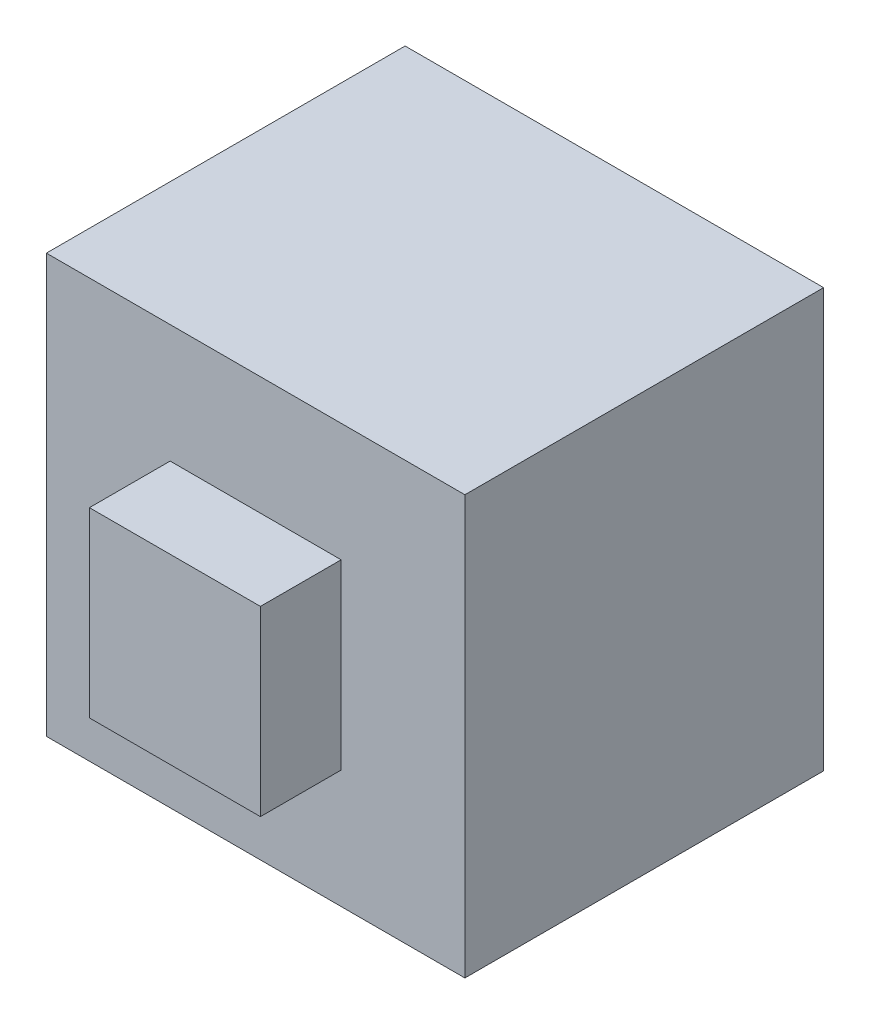
ISO-10303-21;
HEADER;
FILE_DESCRIPTION(('STEP AP214'),'2;1');
FILE_NAME('part.step','',(''),(''),'','','');
FILE_SCHEMA(('AUTOMOTIVE_DESIGN { 1 0 10303 214 1 1 1 1 }'));
ENDSEC;
DATA;
#1=APPLICATION_CONTEXT('core data for automotive mechanical design processes');
#2=APPLICATION_PROTOCOL_DEFINITION('international standard','automotive_design',2000,#1);
#3=PRODUCT_CONTEXT('',#1,'mechanical');
#4=PRODUCT('Part','Part','',(#3));
#5=PRODUCT_RELATED_PRODUCT_CATEGORY('part','',(#4));
#6=PRODUCT_DEFINITION_FORMATION('','',#4);
#7=PRODUCT_DEFINITION_CONTEXT('part definition',#1,'design');
#8=PRODUCT_DEFINITION('design','',#6,#7);
#9=PRODUCT_DEFINITION_SHAPE('','',#8);
#10=(LENGTH_UNIT() NAMED_UNIT(*) SI_UNIT(.MILLI.,.METRE.));
#11=(NAMED_UNIT(*) PLANE_ANGLE_UNIT() SI_UNIT($,.RADIAN.));
#12=(NAMED_UNIT(*) SI_UNIT($,.STERADIAN.) SOLID_ANGLE_UNIT());
#13=UNCERTAINTY_MEASURE_WITH_UNIT(LENGTH_MEASURE(1.E-05),#10,'distance_accuracy_value','');
#14=(GEOMETRIC_REPRESENTATION_CONTEXT(3) GLOBAL_UNCERTAINTY_ASSIGNED_CONTEXT((#13)) GLOBAL_UNIT_ASSIGNED_CONTEXT((#10,
#11,#12)) REPRESENTATION_CONTEXT('',''));
#15=CARTESIAN_POINT('',(0.,0.,0.));
#16=DIRECTION('',(0.,0.,1.));
#17=DIRECTION('',(1.,0.,0.));
#18=AXIS2_PLACEMENT_3D('',#15,#16,#17);
#19=CARTESIAN_POINT('',(70.,70.,120.));
#20=DIRECTION('',(-1.,0.,0.));
#21=DIRECTION('',(0.,-1.,0.));
#22=AXIS2_PLACEMENT_3D('',#19,#20,#21);
#23=PLANE('',#22);
#24=DIRECTION('',(0.,1.,0.));
#25=VECTOR('',#24,1.);
#26=CARTESIAN_POINT('',(70.,70.,0.));
#27=LINE('',#26,#25);
#28=CARTESIAN_POINT('',(70.,-70.,0.));
#29=VERTEX_POINT('',#28);
#30=CARTESIAN_POINT('',(70.,70.,0.));
#31=VERTEX_POINT('',#30);
#32=EDGE_CURVE('E127',#29,#31,#27,.T.);
#33=ORIENTED_EDGE('',*,*,#32,.T.);
#34=DIRECTION('',(0.,0.,-1.));
#35=VECTOR('',#34,1.);
#36=CARTESIAN_POINT('',(70.,70.,120.));
#37=LINE('',#36,#35);
#38=CARTESIAN_POINT('',(70.,70.,120.));
#39=VERTEX_POINT('',#38);
#40=EDGE_CURVE('E11',#39,#31,#37,.T.);
#41=ORIENTED_EDGE('',*,*,#40,.F.);
#42=DIRECTION('',(0.,1.,0.));
#43=VECTOR('',#42,1.);
#44=CARTESIAN_POINT('',(70.,70.,120.));
#45=LINE('',#44,#43);
#46=CARTESIAN_POINT('',(70.,-70.,120.));
#47=VERTEX_POINT('',#46);
#48=EDGE_CURVE('E138',#47,#39,#45,.T.);
#49=ORIENTED_EDGE('',*,*,#48,.F.);
#50=DIRECTION('',(0.,0.,-1.));
#51=VECTOR('',#50,1.);
#52=CARTESIAN_POINT('',(70.,-70.,120.));
#53=LINE('',#52,#51);
#54=EDGE_CURVE('E151',#47,#29,#53,.T.);
#55=ORIENTED_EDGE('',*,*,#54,.T.);
#56=EDGE_LOOP('',(#33,#41,#49,#55));
#57=FACE_BOUND('',#56,.T.);
#58=ADVANCED_FACE('F39',(#57),#23,.F.);
#59=CARTESIAN_POINT('',(-70.,70.,120.));
#60=DIRECTION('',(0.,-1.,0.));
#61=DIRECTION('',(0.,0.,-1.));
#62=AXIS2_PLACEMENT_3D('',#59,#60,#61);
#63=PLANE('',#62);
#64=DIRECTION('',(-1.,0.,0.));
#65=VECTOR('',#64,1.);
#66=CARTESIAN_POINT('',(-70.,70.,0.));
#67=LINE('',#66,#65);
#68=CARTESIAN_POINT('',(-70.,70.,0.));
#69=VERTEX_POINT('',#68);
#70=EDGE_CURVE('E132',#31,#69,#67,.T.);
#71=ORIENTED_EDGE('',*,*,#70,.T.);
#72=DIRECTION('',(0.,0.,-1.));
#73=VECTOR('',#72,1.);
#74=CARTESIAN_POINT('',(-70.,70.,120.));
#75=LINE('',#74,#73);
#76=CARTESIAN_POINT('',(-70.,70.,120.));
#77=VERTEX_POINT('',#76);
#78=EDGE_CURVE('E47',#77,#69,#75,.T.);
#79=ORIENTED_EDGE('',*,*,#78,.F.);
#80=DIRECTION('',(-1.,0.,0.));
#81=VECTOR('',#80,1.);
#82=CARTESIAN_POINT('',(-70.,70.,120.));
#83=LINE('',#82,#81);
#84=EDGE_CURVE('E142',#39,#77,#83,.T.);
#85=ORIENTED_EDGE('',*,*,#84,.F.);
#86=ORIENTED_EDGE('',*,*,#40,.T.);
#87=EDGE_LOOP('',(#71,#79,#85,#86));
#88=FACE_BOUND('',#87,.T.);
#89=ADVANCED_FACE('F188',(#88),#63,.F.);
#90=CARTESIAN_POINT('',(-70.,70.,120.));
#91=DIRECTION('',(1.,0.,0.));
#92=DIRECTION('',(0.,1.,0.));
#93=AXIS2_PLACEMENT_3D('',#90,#91,#92);
#94=PLANE('',#93);
#95=DIRECTION('',(0.,-1.,0.));
#96=VECTOR('',#95,1.);
#97=CARTESIAN_POINT('',(-70.,70.,0.));
#98=LINE('',#97,#96);
#99=CARTESIAN_POINT('',(-70.,-70.,0.));
#100=VERTEX_POINT('',#99);
#101=EDGE_CURVE('E155',#69,#100,#98,.T.);
#102=ORIENTED_EDGE('',*,*,#101,.T.);
#103=DIRECTION('',(0.,0.,-1.));
#104=VECTOR('',#103,1.);
#105=CARTESIAN_POINT('',(-70.,-70.,120.));
#106=LINE('',#105,#104);
#107=CARTESIAN_POINT('',(-70.,-70.,120.));
#108=VERTEX_POINT('',#107);
#109=EDGE_CURVE('E163',#108,#100,#106,.T.);
#110=ORIENTED_EDGE('',*,*,#109,.F.);
#111=DIRECTION('',(0.,-1.,0.));
#112=VECTOR('',#111,1.);
#113=CARTESIAN_POINT('',(-70.,70.,120.));
#114=LINE('',#113,#112);
#115=EDGE_CURVE('E146',#77,#108,#114,.T.);
#116=ORIENTED_EDGE('',*,*,#115,.F.);
#117=ORIENTED_EDGE('',*,*,#78,.T.);
#118=EDGE_LOOP('',(#102,#110,#116,#117));
#119=FACE_BOUND('',#118,.T.);
#120=ADVANCED_FACE('F172',(#119),#94,.F.);
#121=CARTESIAN_POINT('',(-70.,-70.,120.));
#122=DIRECTION('',(0.,1.,0.));
#123=DIRECTION('',(0.,0.,1.));
#124=AXIS2_PLACEMENT_3D('',#121,#122,#123);
#125=PLANE('',#124);
#126=DIRECTION('',(1.,0.,0.));
#127=VECTOR('',#126,1.);
#128=CARTESIAN_POINT('',(-70.,-70.,0.));
#129=LINE('',#128,#127);
#130=EDGE_CURVE('E143',#100,#29,#129,.T.);
#131=ORIENTED_EDGE('',*,*,#130,.T.);
#132=ORIENTED_EDGE('',*,*,#54,.F.);
#133=DIRECTION('',(1.,0.,0.));
#134=VECTOR('',#133,1.);
#135=CARTESIAN_POINT('',(-70.,-70.,120.));
#136=LINE('',#135,#134);
#137=EDGE_CURVE('E149',#108,#47,#136,.T.);
#138=ORIENTED_EDGE('',*,*,#137,.F.);
#139=ORIENTED_EDGE('',*,*,#109,.T.);
#140=EDGE_LOOP('',(#131,#132,#138,#139));
#141=FACE_BOUND('',#140,.T.);
#142=ADVANCED_FACE('F181',(#141),#125,.F.);
#143=CARTESIAN_POINT('',(0.,0.,120.));
#144=DIRECTION('',(0.,0.,1.));
#145=DIRECTION('',(1.,0.,0.));
#146=AXIS2_PLACEMENT_3D('',#143,#144,#145);
#147=PLANE('',#146);
#148=DIRECTION('',(0.,1.,0.));
#149=VECTOR('',#148,1.);
#150=CARTESIAN_POINT('',(28.5995576917895,30.4566718276196,120.));
#151=LINE('',#150,#149);
#152=CARTESIAN_POINT('',(28.5995576917895,-30.4566718276196,120.));
#153=VERTEX_POINT('',#152);
#154=CARTESIAN_POINT('',(28.5995576917895,30.4566718276196,120.));
#155=VERTEX_POINT('',#154);
#156=EDGE_CURVE('E54',#153,#155,#151,.T.);
#157=ORIENTED_EDGE('',*,*,#156,.F.);
#158=DIRECTION('',(1.,0.,0.));
#159=VECTOR('',#158,1.);
#160=CARTESIAN_POINT('',(-28.5995576917895,-30.4566718276196,120.));
#161=LINE('',#160,#159);
#162=CARTESIAN_POINT('',(-28.5995576917895,-30.4566718276196,120.));
#163=VERTEX_POINT('',#162);
#164=EDGE_CURVE('E58',#163,#153,#161,.T.);
#165=ORIENTED_EDGE('',*,*,#164,.F.);
#166=DIRECTION('',(0.,-1.,0.));
#167=VECTOR('',#166,1.);
#168=CARTESIAN_POINT('',(-28.5995576917895,30.4566718276196,120.));
#169=LINE('',#168,#167);
#170=CARTESIAN_POINT('',(-28.5995576917895,30.4566718276196,120.));
#171=VERTEX_POINT('',#170);
#172=EDGE_CURVE('E283',#171,#163,#169,.T.);
#173=ORIENTED_EDGE('',*,*,#172,.F.);
#174=DIRECTION('',(-1.,0.,0.));
#175=VECTOR('',#174,1.);
#176=CARTESIAN_POINT('',(-28.5995576917895,30.4566718276196,120.));
#177=LINE('',#176,#175);
#178=EDGE_CURVE('E293',#155,#171,#177,.T.);
#179=ORIENTED_EDGE('',*,*,#178,.F.);
#180=EDGE_LOOP('',(#157,#165,#173,#179));
#181=FACE_BOUND('',#180,.T.);
#182=ORIENTED_EDGE('',*,*,#48,.T.);
#183=ORIENTED_EDGE('',*,*,#84,.T.);
#184=ORIENTED_EDGE('',*,*,#115,.T.);
#185=ORIENTED_EDGE('',*,*,#137,.T.);
#186=EDGE_LOOP('',(#182,#183,#184,#185));
#187=FACE_BOUND('',#186,.T.);
#188=ADVANCED_FACE('F187',(#181,#187),#147,.T.);
#189=CARTESIAN_POINT('',(0.,0.,0.));
#190=DIRECTION('',(0.,0.,1.));
#191=DIRECTION('',(1.,0.,0.));
#192=AXIS2_PLACEMENT_3D('',#189,#190,#191);
#193=PLANE('',#192);
#194=ORIENTED_EDGE('',*,*,#32,.F.);
#195=ORIENTED_EDGE('',*,*,#130,.F.);
#196=ORIENTED_EDGE('',*,*,#101,.F.);
#197=ORIENTED_EDGE('',*,*,#70,.F.);
#198=EDGE_LOOP('',(#194,#195,#196,#197));
#199=FACE_BOUND('',#198,.T.);
#200=ADVANCED_FACE('F178',(#199),#193,.F.);
#201=CARTESIAN_POINT('',(28.5995576917895,30.4566718276196,147.));
#202=DIRECTION('',(-1.,0.,0.));
#203=DIRECTION('',(0.,0.,1.));
#204=AXIS2_PLACEMENT_3D('',#201,#202,#203);
#205=PLANE('',#204);
#206=ORIENTED_EDGE('',*,*,#156,.T.);
#207=DIRECTION('',(0.,0.,-1.));
#208=VECTOR('',#207,1.);
#209=CARTESIAN_POINT('',(28.5995576917895,30.4566718276196,147.));
#210=LINE('',#209,#208);
#211=CARTESIAN_POINT('',(28.5995576917895,30.4566718276196,147.));
#212=VERTEX_POINT('',#211);
#213=EDGE_CURVE('E107',#212,#155,#210,.T.);
#214=ORIENTED_EDGE('',*,*,#213,.F.);
#215=DIRECTION('',(0.,1.,0.));
#216=VECTOR('',#215,1.);
#217=CARTESIAN_POINT('',(28.5995576917895,30.4566718276196,147.));
#218=LINE('',#217,#216);
#219=CARTESIAN_POINT('',(28.5995576917895,-30.4566718276196,147.));
#220=VERTEX_POINT('',#219);
#221=EDGE_CURVE('E114',#220,#212,#218,.T.);
#222=ORIENTED_EDGE('',*,*,#221,.F.);
#223=DIRECTION('',(0.,0.,-1.));
#224=VECTOR('',#223,1.);
#225=CARTESIAN_POINT('',(28.5995576917895,-30.4566718276196,147.));
#226=LINE('',#225,#224);
#227=EDGE_CURVE('E280',#220,#153,#226,.T.);
#228=ORIENTED_EDGE('',*,*,#227,.T.);
#229=EDGE_LOOP('',(#206,#214,#222,#228));
#230=FACE_BOUND('',#229,.T.);
#231=ADVANCED_FACE('F125',(#230),#205,.F.);
#232=CARTESIAN_POINT('',(-28.5995576917895,30.4566718276196,147.));
#233=DIRECTION('',(0.,-1.,0.));
#234=DIRECTION('',(0.,0.,-1.));
#235=AXIS2_PLACEMENT_3D('',#232,#233,#234);
#236=PLANE('',#235);
#237=ORIENTED_EDGE('',*,*,#178,.T.);
#238=DIRECTION('',(0.,0.,-1.));
#239=VECTOR('',#238,1.);
#240=CARTESIAN_POINT('',(-28.5995576917895,30.4566718276196,147.));
#241=LINE('',#240,#239);
#242=CARTESIAN_POINT('',(-28.5995576917895,30.4566718276196,147.));
#243=VERTEX_POINT('',#242);
#244=EDGE_CURVE('E109',#243,#171,#241,.T.);
#245=ORIENTED_EDGE('',*,*,#244,.F.);
#246=DIRECTION('',(-1.,0.,0.));
#247=VECTOR('',#246,1.);
#248=CARTESIAN_POINT('',(-28.5995576917895,30.4566718276196,147.));
#249=LINE('',#248,#247);
#250=EDGE_CURVE('E102',#212,#243,#249,.T.);
#251=ORIENTED_EDGE('',*,*,#250,.F.);
#252=ORIENTED_EDGE('',*,*,#213,.T.);
#253=EDGE_LOOP('',(#237,#245,#251,#252));
#254=FACE_BOUND('',#253,.T.);
#255=ADVANCED_FACE('F105',(#254),#236,.F.);
#256=CARTESIAN_POINT('',(-28.5995576917895,30.4566718276196,147.));
#257=DIRECTION('',(1.,0.,0.));
#258=DIRECTION('',(0.,0.,-1.));
#259=AXIS2_PLACEMENT_3D('',#256,#257,#258);
#260=PLANE('',#259);
#261=ORIENTED_EDGE('',*,*,#172,.T.);
#262=DIRECTION('',(0.,0.,-1.));
#263=VECTOR('',#262,1.);
#264=CARTESIAN_POINT('',(-28.5995576917895,-30.4566718276196,147.));
#265=LINE('',#264,#263);
#266=CARTESIAN_POINT('',(-28.5995576917895,-30.4566718276196,147.));
#267=VERTEX_POINT('',#266);
#268=EDGE_CURVE('E134',#267,#163,#265,.T.);
#269=ORIENTED_EDGE('',*,*,#268,.F.);
#270=DIRECTION('',(0.,-1.,0.));
#271=VECTOR('',#270,1.);
#272=CARTESIAN_POINT('',(-28.5995576917895,30.4566718276196,147.));
#273=LINE('',#272,#271);
#274=EDGE_CURVE('E113',#243,#267,#273,.T.);
#275=ORIENTED_EDGE('',*,*,#274,.F.);
#276=ORIENTED_EDGE('',*,*,#244,.T.);
#277=EDGE_LOOP('',(#261,#269,#275,#276));
#278=FACE_BOUND('',#277,.T.);
#279=ADVANCED_FACE('F206',(#278),#260,.F.);
#280=CARTESIAN_POINT('',(-28.5995576917895,-30.4566718276196,147.));
#281=DIRECTION('',(0.,1.,0.));
#282=DIRECTION('',(0.,0.,1.));
#283=AXIS2_PLACEMENT_3D('',#280,#281,#282);
#284=PLANE('',#283);
#285=ORIENTED_EDGE('',*,*,#164,.T.);
#286=ORIENTED_EDGE('',*,*,#227,.F.);
#287=DIRECTION('',(1.,0.,0.));
#288=VECTOR('',#287,1.);
#289=CARTESIAN_POINT('',(-28.5995576917895,-30.4566718276196,147.));
#290=LINE('',#289,#288);
#291=EDGE_CURVE('E119',#267,#220,#290,.T.);
#292=ORIENTED_EDGE('',*,*,#291,.F.);
#293=ORIENTED_EDGE('',*,*,#268,.T.);
#294=EDGE_LOOP('',(#285,#286,#292,#293));
#295=FACE_BOUND('',#294,.T.);
#296=ADVANCED_FACE('F209',(#295),#284,.F.);
#297=CARTESIAN_POINT('',(0.,0.,147.));
#298=DIRECTION('',(0.,0.,1.));
#299=DIRECTION('',(1.,0.,0.));
#300=AXIS2_PLACEMENT_3D('',#297,#298,#299);
#301=PLANE('',#300);
#302=ORIENTED_EDGE('',*,*,#221,.T.);
#303=ORIENTED_EDGE('',*,*,#250,.T.);
#304=ORIENTED_EDGE('',*,*,#274,.T.);
#305=ORIENTED_EDGE('',*,*,#291,.T.);
#306=EDGE_LOOP('',(#302,#303,#304,#305));
#307=FACE_BOUND('',#306,.T.);
#308=ADVANCED_FACE('F117',(#307),#301,.T.);
#309=CLOSED_SHELL('',(#58,#89,#120,#142,#188,#200,#231,#255,#279,#296,#308));
#310=MANIFOLD_SOLID_BREP('B2',#309);
#311=ADVANCED_BREP_SHAPE_REPRESENTATION('',(#18,#310),#14);
#312=SHAPE_DEFINITION_REPRESENTATION(#9,#311);
ENDSEC;
END-ISO-10303-21;
